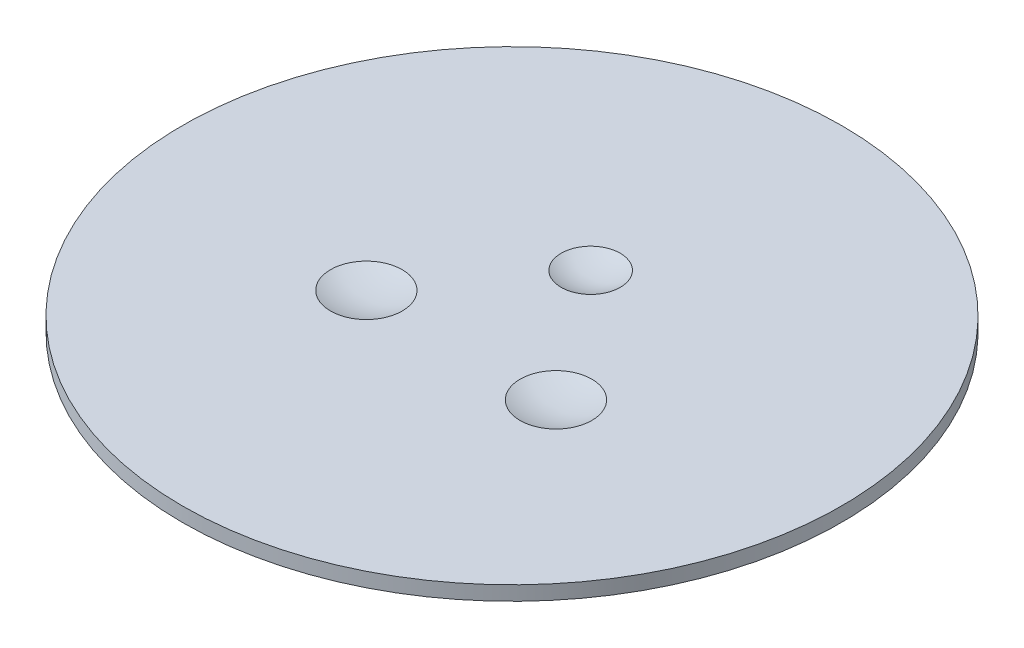
ISO-10303-21;
HEADER;
FILE_DESCRIPTION(('STEP AP214'),'2;1');
FILE_NAME('part.step','',(''),(''),'','','');
FILE_SCHEMA(('AUTOMOTIVE_DESIGN { 1 0 10303 214 1 1 1 1 }'));
ENDSEC;
DATA;
#1=APPLICATION_CONTEXT('core data for automotive mechanical design processes');
#2=APPLICATION_PROTOCOL_DEFINITION('international standard','automotive_design',2000,#1);
#3=PRODUCT_CONTEXT('',#1,'mechanical');
#4=PRODUCT('Part','Part','',(#3));
#5=PRODUCT_RELATED_PRODUCT_CATEGORY('part','',(#4));
#6=PRODUCT_DEFINITION_FORMATION('','',#4);
#7=PRODUCT_DEFINITION_CONTEXT('part definition',#1,'design');
#8=PRODUCT_DEFINITION('design','',#6,#7);
#9=PRODUCT_DEFINITION_SHAPE('','',#8);
#10=(LENGTH_UNIT() NAMED_UNIT(*) SI_UNIT(.MILLI.,.METRE.));
#11=(NAMED_UNIT(*) PLANE_ANGLE_UNIT() SI_UNIT($,.RADIAN.));
#12=(NAMED_UNIT(*) SI_UNIT($,.STERADIAN.) SOLID_ANGLE_UNIT());
#13=UNCERTAINTY_MEASURE_WITH_UNIT(LENGTH_MEASURE(1.E-05),#10,'distance_accuracy_value','');
#14=(GEOMETRIC_REPRESENTATION_CONTEXT(3) GLOBAL_UNCERTAINTY_ASSIGNED_CONTEXT((#13)) GLOBAL_UNIT_ASSIGNED_CONTEXT((#10,
#11,#12)) REPRESENTATION_CONTEXT('',''));
#15=CARTESIAN_POINT('',(0.,0.,0.));
#16=DIRECTION('',(0.,0.,1.));
#17=DIRECTION('',(1.,0.,0.));
#18=AXIS2_PLACEMENT_3D('',#15,#16,#17);
#19=CARTESIAN_POINT('',(0.,50.,0.));
#20=DIRECTION('',(0.,-1.,0.));
#21=DIRECTION('',(0.,0.,-1.));
#22=AXIS2_PLACEMENT_3D('',#19,#20,#21);
#23=CYLINDRICAL_SURFACE('',#22,1150.);
#24=CARTESIAN_POINT('',(0.,50.,0.));
#25=DIRECTION('',(0.,1.,0.));
#26=DIRECTION('',(0.,0.,1.));
#27=AXIS2_PLACEMENT_3D('',#24,#25,#26);
#28=CIRCLE('',#27,1150.);
#29=CARTESIAN_POINT('',(0.,50.,1150.));
#30=VERTEX_POINT('',#29);
#31=EDGE_CURVE('E10',#30,#30,#28,.T.);
#32=ORIENTED_EDGE('',*,*,#31,.F.);
#33=EDGE_LOOP('',(#32));
#34=FACE_BOUND('',#33,.T.);
#35=CARTESIAN_POINT('',(0.,0.,0.));
#36=DIRECTION('',(0.,1.,0.));
#37=DIRECTION('',(0.,0.,1.));
#38=AXIS2_PLACEMENT_3D('',#35,#36,#37);
#39=CIRCLE('',#38,1150.);
#40=CARTESIAN_POINT('',(0.,0.,1150.));
#41=VERTEX_POINT('',#40);
#42=EDGE_CURVE('E41',#41,#41,#39,.T.);
#43=ORIENTED_EDGE('',*,*,#42,.T.);
#44=EDGE_LOOP('',(#43));
#45=FACE_BOUND('',#44,.T.);
#46=ADVANCED_FACE('F38',(#34,#45),#23,.T.);
#47=CARTESIAN_POINT('',(0.,50.,0.));
#48=DIRECTION('',(0.,1.,0.));
#49=DIRECTION('',(0.,0.,1.));
#50=AXIS2_PLACEMENT_3D('',#47,#48,#49);
#51=PLANE('',#50);
#52=CARTESIAN_POINT('',(0.,49.9999999999998,-274.523238615916));
#53=DIRECTION('',(0.,-1.,0.));
#54=DIRECTION('',(0.,0.,-1.));
#55=AXIS2_PLACEMENT_3D('',#52,#53,#54);
#56=CIRCLE('',#55,103.159875920825);
#57=CARTESIAN_POINT('',(0.,49.9999999999998,-377.68311453674));
#58=VERTEX_POINT('',#57);
#59=EDGE_CURVE('E55',#58,#58,#56,.T.);
#60=ORIENTED_EDGE('',*,*,#59,.T.);
#61=EDGE_LOOP('',(#60));
#62=FACE_BOUND('',#61,.T.);
#63=CARTESIAN_POINT('',(330.835,49.9999999999941,177.391142296));
#64=DIRECTION('',(0.,1.,0.));
#65=DIRECTION('',(-1.,0.,0.));
#66=AXIS2_PLACEMENT_3D('',#63,#64,#65);
#67=CIRCLE('',#66,125.062704272696);
#68=CARTESIAN_POINT('',(205.772295727304,49.9999999999997,177.391142296));
#69=VERTEX_POINT('',#68);
#70=EDGE_CURVE('E52',#69,#69,#67,.T.);
#71=ORIENTED_EDGE('',*,*,#70,.F.);
#72=EDGE_LOOP('',(#71));
#73=FACE_BOUND('',#72,.T.);
#74=CARTESIAN_POINT('',(-330.835,49.9999999999822,177.391142296));
#75=DIRECTION('',(1.39906153509675E-13,-1.,0.));
#76=DIRECTION('',(1.,1.39906153509675E-13,0.));
#77=AXIS2_PLACEMENT_3D('',#74,#75,#76);
#78=CIRCLE('',#77,125.062704272696);
#79=CARTESIAN_POINT('',(-205.772295727304,49.9999999999997,177.391142296));
#80=VERTEX_POINT('',#79);
#81=EDGE_CURVE('E48',#80,#80,#78,.T.);
#82=ORIENTED_EDGE('',*,*,#81,.T.);
#83=EDGE_LOOP('',(#82));
#84=FACE_BOUND('',#83,.T.);
#85=ORIENTED_EDGE('',*,*,#31,.T.);
#86=EDGE_LOOP('',(#85));
#87=FACE_BOUND('',#86,.T.);
#88=ADVANCED_FACE('F59',(#62,#73,#84,#87),#51,.T.);
#89=CARTESIAN_POINT('',(0.,0.,0.));
#90=DIRECTION('',(0.,1.,0.));
#91=DIRECTION('',(0.,0.,1.));
#92=AXIS2_PLACEMENT_3D('',#89,#90,#91);
#93=PLANE('',#92);
#94=ORIENTED_EDGE('',*,*,#42,.F.);
#95=EDGE_LOOP('',(#94));
#96=FACE_BOUND('',#95,.T.);
#97=ADVANCED_FACE('F77',(#96),#93,.F.);
#98=CARTESIAN_POINT('',(-330.835,355.6,177.391142296));
#99=DIRECTION('',(1.39906153509675E-13,-1.,0.));
#100=DIRECTION('',(-1.,-1.39906153509675E-13,0.));
#101=AXIS2_PLACEMENT_3D('',#98,#99,#100);
#102=SPHERICAL_SURFACE('',#101,330.2);
#103=ORIENTED_EDGE('',*,*,#81,.F.);
#104=EDGE_LOOP('',(#103));
#105=FACE_BOUND('',#104,.T.);
#106=ADVANCED_FACE('F69',(#105),#102,.F.);
#107=CARTESIAN_POINT('',(330.835,355.6,177.391142296));
#108=DIRECTION('',(0.,1.,0.));
#109=DIRECTION('',(1.,0.,0.));
#110=AXIS2_PLACEMENT_3D('',#107,#108,#109);
#111=SPHERICAL_SURFACE('',#110,330.2);
#112=ORIENTED_EDGE('',*,*,#70,.T.);
#113=EDGE_LOOP('',(#112));
#114=FACE_BOUND('',#113,.T.);
#115=ADVANCED_FACE('F64',(#114),#111,.F.);
#116=CARTESIAN_POINT('',(0.,254.,-274.523238615916));
#117=DIRECTION('',(0.,-1.,0.));
#118=DIRECTION('',(-1.,0.,0.));
#119=AXIS2_PLACEMENT_3D('',#116,#117,#118);
#120=SPHERICAL_SURFACE('',#119,228.6);
#121=ORIENTED_EDGE('',*,*,#59,.F.);
#122=EDGE_LOOP('',(#121));
#123=FACE_BOUND('',#122,.T.);
#124=ADVANCED_FACE('F62',(#123),#120,.F.);
#125=CLOSED_SHELL('',(#46,#88,#97,#106,#115,#124));
#126=MANIFOLD_SOLID_BREP('B2',#125);
#127=ADVANCED_BREP_SHAPE_REPRESENTATION('',(#18,#126),#14);
#128=SHAPE_DEFINITION_REPRESENTATION(#9,#127);
ENDSEC;
END-ISO-10303-21;
